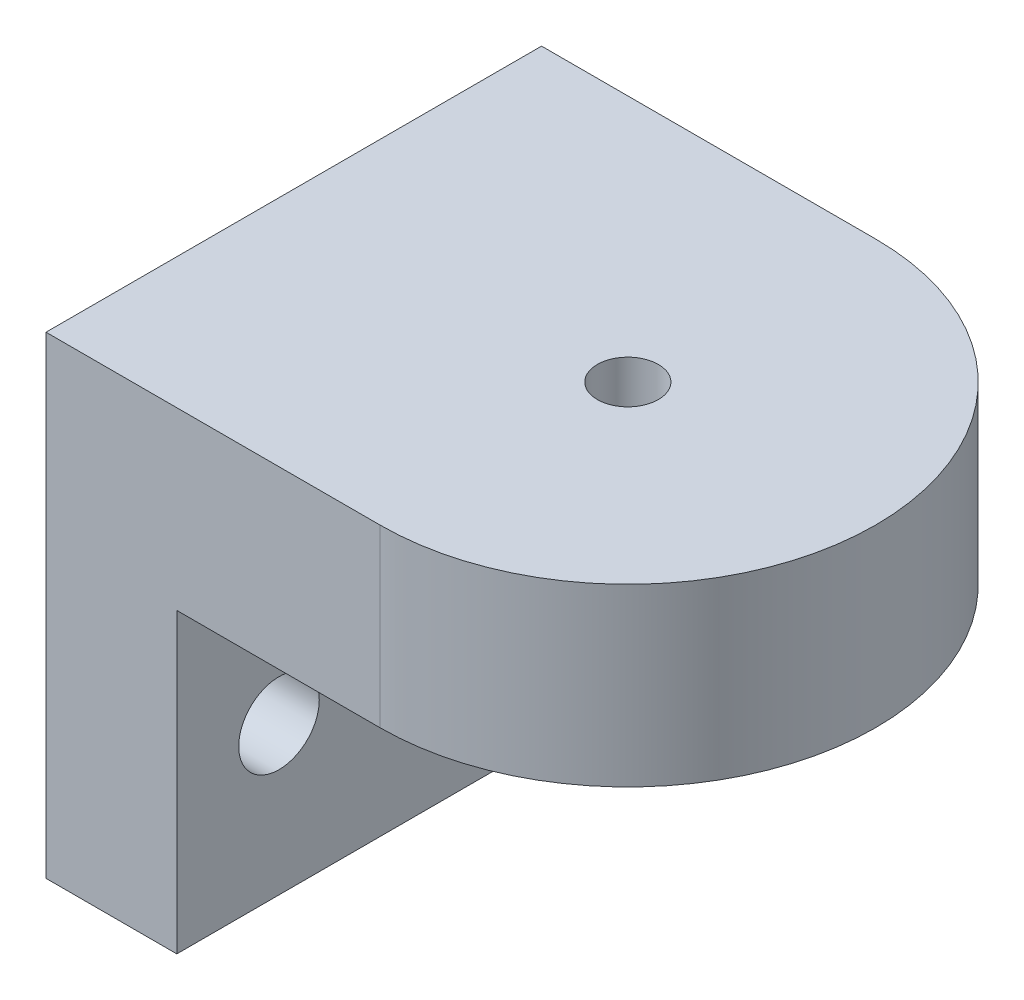
ISO-10303-21;
HEADER;
FILE_DESCRIPTION(('STEP AP214'),'2;1');
FILE_NAME('part.step','',(''),(''),'','','');
FILE_SCHEMA(('AUTOMOTIVE_DESIGN { 1 0 10303 214 1 1 1 1 }'));
ENDSEC;
DATA;
#1=APPLICATION_CONTEXT('core data for automotive mechanical design processes');
#2=APPLICATION_PROTOCOL_DEFINITION('international standard','automotive_design',2000,#1);
#3=PRODUCT_CONTEXT('',#1,'mechanical');
#4=PRODUCT('Part','Part','',(#3));
#5=PRODUCT_RELATED_PRODUCT_CATEGORY('part','',(#4));
#6=PRODUCT_DEFINITION_FORMATION('','',#4);
#7=PRODUCT_DEFINITION_CONTEXT('part definition',#1,'design');
#8=PRODUCT_DEFINITION('design','',#6,#7);
#9=PRODUCT_DEFINITION_SHAPE('','',#8);
#10=(LENGTH_UNIT() NAMED_UNIT(*) SI_UNIT(.MILLI.,.METRE.));
#11=(NAMED_UNIT(*) PLANE_ANGLE_UNIT() SI_UNIT($,.RADIAN.));
#12=(NAMED_UNIT(*) SI_UNIT($,.STERADIAN.) SOLID_ANGLE_UNIT());
#13=UNCERTAINTY_MEASURE_WITH_UNIT(LENGTH_MEASURE(1.E-05),#10,'distance_accuracy_value','');
#14=(GEOMETRIC_REPRESENTATION_CONTEXT(3) GLOBAL_UNCERTAINTY_ASSIGNED_CONTEXT((#13)) GLOBAL_UNIT_ASSIGNED_CONTEXT((#10,
#11,#12)) REPRESENTATION_CONTEXT('',''));
#15=CARTESIAN_POINT('',(0.,0.,0.));
#16=DIRECTION('',(0.,0.,1.));
#17=DIRECTION('',(1.,0.,0.));
#18=AXIS2_PLACEMENT_3D('',#15,#16,#17);
#19=CARTESIAN_POINT('',(8.9916,0.,0.));
#20=DIRECTION('',(-1.,0.,0.));
#21=DIRECTION('',(0.,0.,1.));
#22=AXIS2_PLACEMENT_3D('',#19,#20,#21);
#23=PLANE('',#22);
#24=CARTESIAN_POINT('',(8.9916,-6.0325,-10.0076));
#25=DIRECTION('',(1.,0.,0.));
#26=DIRECTION('',(0.,0.,-1.));
#27=AXIS2_PLACEMENT_3D('',#24,#25,#26);
#28=CIRCLE('',#27,2.6416);
#29=CARTESIAN_POINT('',(8.9916,-6.0325,-12.6492));
#30=VERTEX_POINT('',#29);
#31=EDGE_CURVE('E149',#30,#30,#28,.T.);
#32=ORIENTED_EDGE('',*,*,#31,.F.);
#33=EDGE_LOOP('',(#32));
#34=FACE_BOUND('',#33,.T.);
#35=CARTESIAN_POINT('',(8.9916,-6.0325,10.0076));
#36=DIRECTION('',(1.,0.,0.));
#37=DIRECTION('',(0.,0.,-1.));
#38=AXIS2_PLACEMENT_3D('',#35,#36,#37);
#39=CIRCLE('',#38,2.7686);
#40=CARTESIAN_POINT('',(8.9916,-6.0325,7.239));
#41=VERTEX_POINT('',#40);
#42=EDGE_CURVE('E143',#41,#41,#39,.T.);
#43=ORIENTED_EDGE('',*,*,#42,.F.);
#44=EDGE_LOOP('',(#43));
#45=FACE_BOUND('',#44,.T.);
#46=DIRECTION('',(0.,0.,-1.));
#47=VECTOR('',#46,1.);
#48=CARTESIAN_POINT('',(8.9916,4.191,17.0307));
#49=LINE('',#48,#47);
#50=CARTESIAN_POINT('',(8.9916,4.191,17.0307));
#51=VERTEX_POINT('',#50);
#52=CARTESIAN_POINT('',(8.9916,4.191,-17.0307));
#53=VERTEX_POINT('',#52);
#54=EDGE_CURVE('E50',#51,#53,#49,.T.);
#55=ORIENTED_EDGE('',*,*,#54,.F.);
#56=DIRECTION('',(0.,-1.,0.));
#57=VECTOR('',#56,1.);
#58=CARTESIAN_POINT('',(8.9916,-16.256,17.0307));
#59=LINE('',#58,#57);
#60=CARTESIAN_POINT('',(8.9916,-16.256,17.0307));
#61=VERTEX_POINT('',#60);
#62=EDGE_CURVE('E110',#51,#61,#59,.T.);
#63=ORIENTED_EDGE('',*,*,#62,.T.);
#64=DIRECTION('',(0.,0.,-1.));
#65=VECTOR('',#64,1.);
#66=CARTESIAN_POINT('',(8.9916,-16.256,17.0307));
#67=LINE('',#66,#65);
#68=CARTESIAN_POINT('',(8.9916,-16.256,-17.0307));
#69=VERTEX_POINT('',#68);
#70=EDGE_CURVE('E56',#61,#69,#67,.T.);
#71=ORIENTED_EDGE('',*,*,#70,.T.);
#72=DIRECTION('',(0.,1.,0.));
#73=VECTOR('',#72,1.);
#74=CARTESIAN_POINT('',(8.9916,-16.256,-17.0307));
#75=LINE('',#74,#73);
#76=EDGE_CURVE('E85',#69,#53,#75,.T.);
#77=ORIENTED_EDGE('',*,*,#76,.T.);
#78=EDGE_LOOP('',(#55,#63,#71,#77));
#79=FACE_BOUND('',#78,.T.);
#80=ADVANCED_FACE('F33',(#34,#45,#79),#23,.F.);
#81=CARTESIAN_POINT('',(8.9916,-16.256,-17.0307));
#82=DIRECTION('',(0.,0.,1.));
#83=DIRECTION('',(1.,0.,0.));
#84=AXIS2_PLACEMENT_3D('',#81,#82,#83);
#85=PLANE('',#84);
#86=DIRECTION('',(0.,1.,0.));
#87=VECTOR('',#86,1.);
#88=CARTESIAN_POINT('',(0.,-16.256,-17.0307));
#89=LINE('',#88,#87);
#90=CARTESIAN_POINT('',(0.,-16.256,-17.0307));
#91=VERTEX_POINT('',#90);
#92=CARTESIAN_POINT('',(0.,16.256,-17.0307));
#93=VERTEX_POINT('',#92);
#94=EDGE_CURVE('E91',#91,#93,#89,.T.);
#95=ORIENTED_EDGE('',*,*,#94,.T.);
#96=DIRECTION('',(-1.,0.,0.));
#97=VECTOR('',#96,1.);
#98=CARTESIAN_POINT('',(8.9916,16.256,-17.0307));
#99=LINE('',#98,#97);
#100=CARTESIAN_POINT('',(22.9616,16.256,-17.0307));
#101=VERTEX_POINT('',#100);
#102=EDGE_CURVE('E11',#101,#93,#99,.T.);
#103=ORIENTED_EDGE('',*,*,#102,.F.);
#104=DIRECTION('',(0.,1.,0.));
#105=VECTOR('',#104,1.);
#106=CARTESIAN_POINT('',(22.9616,16.256,-17.0307));
#107=LINE('',#106,#105);
#108=CARTESIAN_POINT('',(22.9616,4.191,-17.0307));
#109=VERTEX_POINT('',#108);
#110=EDGE_CURVE('E117',#109,#101,#107,.T.);
#111=ORIENTED_EDGE('',*,*,#110,.F.);
#112=DIRECTION('',(-1.,0.,0.));
#113=VECTOR('',#112,1.);
#114=CARTESIAN_POINT('',(22.9616,4.191,-17.0307));
#115=LINE('',#114,#113);
#116=EDGE_CURVE('E100',#109,#53,#115,.T.);
#117=ORIENTED_EDGE('',*,*,#116,.T.);
#118=ORIENTED_EDGE('',*,*,#76,.F.);
#119=DIRECTION('',(-1.,0.,0.));
#120=VECTOR('',#119,1.);
#121=CARTESIAN_POINT('',(8.9916,-16.256,-17.0307));
#122=LINE('',#121,#120);
#123=EDGE_CURVE('E78',#69,#91,#122,.T.);
#124=ORIENTED_EDGE('',*,*,#123,.T.);
#125=EDGE_LOOP('',(#95,#103,#111,#117,#118,#124));
#126=FACE_BOUND('',#125,.T.);
#127=ADVANCED_FACE('F35',(#126),#85,.F.);
#128=CARTESIAN_POINT('',(8.9916,16.256,17.0307));
#129=DIRECTION('',(0.,-1.,0.));
#130=DIRECTION('',(0.,0.,-1.));
#131=AXIS2_PLACEMENT_3D('',#128,#129,#130);
#132=PLANE('',#131);
#133=CARTESIAN_POINT('',(22.9616,16.256,0.));
#134=DIRECTION('',(0.,1.,0.));
#135=DIRECTION('',(0.,0.,1.));
#136=AXIS2_PLACEMENT_3D('',#133,#134,#135);
#137=CIRCLE('',#136,2.0955);
#138=CARTESIAN_POINT('',(22.9616,16.256,2.0955));
#139=VERTEX_POINT('',#138);
#140=EDGE_CURVE('E140',#139,#139,#137,.T.);
#141=ORIENTED_EDGE('',*,*,#140,.F.);
#142=EDGE_LOOP('',(#141));
#143=FACE_BOUND('',#142,.T.);
#144=DIRECTION('',(0.,0.,1.));
#145=VECTOR('',#144,1.);
#146=CARTESIAN_POINT('',(0.,16.256,17.0307));
#147=LINE('',#146,#145);
#148=CARTESIAN_POINT('',(0.,16.256,17.0307));
#149=VERTEX_POINT('',#148);
#150=EDGE_CURVE('E95',#93,#149,#147,.T.);
#151=ORIENTED_EDGE('',*,*,#150,.T.);
#152=DIRECTION('',(-1.,0.,0.));
#153=VECTOR('',#152,1.);
#154=CARTESIAN_POINT('',(8.9916,16.256,17.0307));
#155=LINE('',#154,#153);
#156=CARTESIAN_POINT('',(22.9615999999999,16.256,17.0307));
#157=VERTEX_POINT('',#156);
#158=EDGE_CURVE('E42',#157,#149,#155,.T.);
#159=ORIENTED_EDGE('',*,*,#158,.F.);
#160=CARTESIAN_POINT('',(22.9616,16.256,0.));
#161=DIRECTION('',(0.,1.,0.));
#162=DIRECTION('',(0.,0.,1.));
#163=AXIS2_PLACEMENT_3D('',#160,#161,#162);
#164=CIRCLE('',#163,17.0307);
#165=EDGE_CURVE('E136',#157,#101,#164,.T.);
#166=ORIENTED_EDGE('',*,*,#165,.T.);
#167=ORIENTED_EDGE('',*,*,#102,.T.);
#168=EDGE_LOOP('',(#151,#159,#166,#167));
#169=FACE_BOUND('',#168,.T.);
#170=ADVANCED_FACE('F198',(#143,#169),#132,.F.);
#171=CARTESIAN_POINT('',(8.9916,-16.256,17.0307));
#172=DIRECTION('',(0.,0.,-1.));
#173=DIRECTION('',(-1.,0.,0.));
#174=AXIS2_PLACEMENT_3D('',#171,#172,#173);
#175=PLANE('',#174);
#176=DIRECTION('',(0.,-1.,0.));
#177=VECTOR('',#176,1.);
#178=CARTESIAN_POINT('',(0.,-16.256,17.0307));
#179=LINE('',#178,#177);
#180=CARTESIAN_POINT('',(0.,-16.256,17.0307));
#181=VERTEX_POINT('',#180);
#182=EDGE_CURVE('E86',#149,#181,#179,.T.);
#183=ORIENTED_EDGE('',*,*,#182,.T.);
#184=DIRECTION('',(-1.,0.,0.));
#185=VECTOR('',#184,1.);
#186=CARTESIAN_POINT('',(8.9916,-16.256,17.0307));
#187=LINE('',#186,#185);
#188=EDGE_CURVE('E81',#61,#181,#187,.T.);
#189=ORIENTED_EDGE('',*,*,#188,.F.);
#190=ORIENTED_EDGE('',*,*,#62,.F.);
#191=DIRECTION('',(-1.,0.,0.));
#192=VECTOR('',#191,1.);
#193=CARTESIAN_POINT('',(22.9616,4.191,17.0307));
#194=LINE('',#193,#192);
#195=CARTESIAN_POINT('',(22.9616,4.191,17.0307));
#196=VERTEX_POINT('',#195);
#197=EDGE_CURVE('E96',#196,#51,#194,.T.);
#198=ORIENTED_EDGE('',*,*,#197,.F.);
#199=DIRECTION('',(0.,-1.,0.));
#200=VECTOR('',#199,1.);
#201=CARTESIAN_POINT('',(22.9616,16.256,17.0307));
#202=LINE('',#201,#200);
#203=EDGE_CURVE('E120',#157,#196,#202,.T.);
#204=ORIENTED_EDGE('',*,*,#203,.F.);
#205=ORIENTED_EDGE('',*,*,#158,.T.);
#206=EDGE_LOOP('',(#183,#189,#190,#198,#204,#205));
#207=FACE_BOUND('',#206,.T.);
#208=ADVANCED_FACE('F196',(#207),#175,.F.);
#209=CARTESIAN_POINT('',(8.9916,-16.256,17.0307));
#210=DIRECTION('',(0.,1.,0.));
#211=DIRECTION('',(0.,0.,1.));
#212=AXIS2_PLACEMENT_3D('',#209,#210,#211);
#213=PLANE('',#212);
#214=DIRECTION('',(0.,0.,-1.));
#215=VECTOR('',#214,1.);
#216=CARTESIAN_POINT('',(0.,-16.256,17.0307));
#217=LINE('',#216,#215);
#218=EDGE_CURVE('E75',#181,#91,#217,.T.);
#219=ORIENTED_EDGE('',*,*,#218,.T.);
#220=ORIENTED_EDGE('',*,*,#123,.F.);
#221=ORIENTED_EDGE('',*,*,#70,.F.);
#222=ORIENTED_EDGE('',*,*,#188,.T.);
#223=EDGE_LOOP('',(#219,#220,#221,#222));
#224=FACE_BOUND('',#223,.T.);
#225=ADVANCED_FACE('F77',(#224),#213,.F.);
#226=CARTESIAN_POINT('',(0.,0.,0.));
#227=DIRECTION('',(-1.,0.,0.));
#228=DIRECTION('',(0.,0.,1.));
#229=AXIS2_PLACEMENT_3D('',#226,#227,#228);
#230=PLANE('',#229);
#231=CARTESIAN_POINT('',(0.,-6.0325,-10.0076));
#232=DIRECTION('',(-1.,0.,0.));
#233=DIRECTION('',(0.,0.,1.));
#234=AXIS2_PLACEMENT_3D('',#231,#232,#233);
#235=CIRCLE('',#234,2.6416);
#236=CARTESIAN_POINT('',(0.,-6.0325,-7.366));
#237=VERTEX_POINT('',#236);
#238=EDGE_CURVE('E152',#237,#237,#235,.F.);
#239=ORIENTED_EDGE('',*,*,#238,.T.);
#240=EDGE_LOOP('',(#239));
#241=FACE_BOUND('',#240,.T.);
#242=CARTESIAN_POINT('',(0.,-6.0325,10.0076));
#243=DIRECTION('',(-1.,0.,0.));
#244=DIRECTION('',(0.,0.,1.));
#245=AXIS2_PLACEMENT_3D('',#242,#243,#244);
#246=CIRCLE('',#245,2.7686);
#247=CARTESIAN_POINT('',(0.,-6.0325,12.7762));
#248=VERTEX_POINT('',#247);
#249=EDGE_CURVE('E146',#248,#248,#246,.F.);
#250=ORIENTED_EDGE('',*,*,#249,.T.);
#251=EDGE_LOOP('',(#250));
#252=FACE_BOUND('',#251,.T.);
#253=ORIENTED_EDGE('',*,*,#94,.F.);
#254=ORIENTED_EDGE('',*,*,#218,.F.);
#255=ORIENTED_EDGE('',*,*,#182,.F.);
#256=ORIENTED_EDGE('',*,*,#150,.F.);
#257=EDGE_LOOP('',(#253,#254,#255,#256));
#258=FACE_BOUND('',#257,.T.);
#259=ADVANCED_FACE('F94',(#241,#252,#258),#230,.T.);
#260=CARTESIAN_POINT('',(22.9616,4.191,17.0307));
#261=DIRECTION('',(0.,1.,0.));
#262=DIRECTION('',(0.,0.,1.));
#263=AXIS2_PLACEMENT_3D('',#260,#261,#262);
#264=PLANE('',#263);
#265=ORIENTED_EDGE('',*,*,#54,.T.);
#266=ORIENTED_EDGE('',*,*,#116,.F.);
#267=CARTESIAN_POINT('',(22.9616,4.191,0.));
#268=DIRECTION('',(0.,1.,0.));
#269=DIRECTION('',(0.,0.,1.));
#270=AXIS2_PLACEMENT_3D('',#267,#268,#269);
#271=CIRCLE('',#270,17.0307);
#272=EDGE_CURVE('E121',#196,#109,#271,.T.);
#273=ORIENTED_EDGE('',*,*,#272,.F.);
#274=ORIENTED_EDGE('',*,*,#197,.T.);
#275=EDGE_LOOP('',(#265,#266,#273,#274));
#276=FACE_BOUND('',#275,.T.);
#277=ADVANCED_FACE('F187',(#276),#264,.F.);
#278=CARTESIAN_POINT('',(22.9616,16.256,0.));
#279=DIRECTION('',(0.,1.,0.));
#280=DIRECTION('',(0.,0.,1.));
#281=AXIS2_PLACEMENT_3D('',#278,#279,#280);
#282=CYLINDRICAL_SURFACE('',#281,17.0307);
#283=ORIENTED_EDGE('',*,*,#165,.F.);
#284=ORIENTED_EDGE('',*,*,#203,.T.);
#285=ORIENTED_EDGE('',*,*,#272,.T.);
#286=ORIENTED_EDGE('',*,*,#110,.T.);
#287=EDGE_LOOP('',(#283,#284,#285,#286));
#288=FACE_BOUND('',#287,.T.);
#289=ADVANCED_FACE('F183',(#288),#282,.T.);
#290=CARTESIAN_POINT('',(22.9616,8.636,0.));
#291=DIRECTION('',(0.,1.,0.));
#292=DIRECTION('',(0.,0.,1.));
#293=AXIS2_PLACEMENT_3D('',#290,#291,#292);
#294=CYLINDRICAL_SURFACE('',#293,2.0955);
#295=CARTESIAN_POINT('',(22.9616,8.636,0.));
#296=DIRECTION('',(0.,1.,0.));
#297=DIRECTION('',(0.,0.,1.));
#298=AXIS2_PLACEMENT_3D('',#295,#296,#297);
#299=CIRCLE('',#298,2.0955);
#300=CARTESIAN_POINT('',(22.9616,8.636,2.0955));
#301=VERTEX_POINT('',#300);
#302=EDGE_CURVE('E139',#301,#301,#299,.T.);
#303=ORIENTED_EDGE('',*,*,#302,.F.);
#304=EDGE_LOOP('',(#303));
#305=FACE_BOUND('',#304,.T.);
#306=ORIENTED_EDGE('',*,*,#140,.T.);
#307=EDGE_LOOP('',(#306));
#308=FACE_BOUND('',#307,.T.);
#309=ADVANCED_FACE('F176',(#305,#308),#294,.F.);
#310=CARTESIAN_POINT('',(22.9616,8.636,0.));
#311=DIRECTION('',(0.,1.,0.));
#312=DIRECTION('',(0.,0.,1.));
#313=AXIS2_PLACEMENT_3D('',#310,#311,#312);
#314=PLANE('',#313);
#315=ORIENTED_EDGE('',*,*,#302,.T.);
#316=EDGE_LOOP('',(#315));
#317=FACE_BOUND('',#316,.T.);
#318=ADVANCED_FACE('F167',(#317),#314,.T.);
#319=CARTESIAN_POINT('',(-0.000999999999999265,-6.0325,10.0076));
#320=DIRECTION('',(1.,0.,0.));
#321=DIRECTION('',(0.,0.,-1.));
#322=AXIS2_PLACEMENT_3D('',#319,#320,#321);
#323=CYLINDRICAL_SURFACE('',#322,2.7686);
#324=ORIENTED_EDGE('',*,*,#249,.F.);
#325=EDGE_LOOP('',(#324));
#326=FACE_BOUND('',#325,.T.);
#327=ORIENTED_EDGE('',*,*,#42,.T.);
#328=EDGE_LOOP('',(#327));
#329=FACE_BOUND('',#328,.T.);
#330=ADVANCED_FACE('F165',(#326,#329),#323,.F.);
#331=CARTESIAN_POINT('',(-0.000999999999999265,-6.0325,-10.0076));
#332=DIRECTION('',(1.,0.,0.));
#333=DIRECTION('',(0.,0.,-1.));
#334=AXIS2_PLACEMENT_3D('',#331,#332,#333);
#335=CYLINDRICAL_SURFACE('',#334,2.6416);
#336=ORIENTED_EDGE('',*,*,#238,.F.);
#337=EDGE_LOOP('',(#336));
#338=FACE_BOUND('',#337,.T.);
#339=ORIENTED_EDGE('',*,*,#31,.T.);
#340=EDGE_LOOP('',(#339));
#341=FACE_BOUND('',#340,.T.);
#342=ADVANCED_FACE('F158',(#338,#341),#335,.F.);
#343=CLOSED_SHELL('',(#80,#127,#170,#208,#225,#259,#277,#289,#309,#318,#330,#342));
#344=MANIFOLD_SOLID_BREP('B2',#343);
#345=ADVANCED_BREP_SHAPE_REPRESENTATION('',(#18,#344),#14);
#346=SHAPE_DEFINITION_REPRESENTATION(#9,#345);
ENDSEC;
END-ISO-10303-21;
